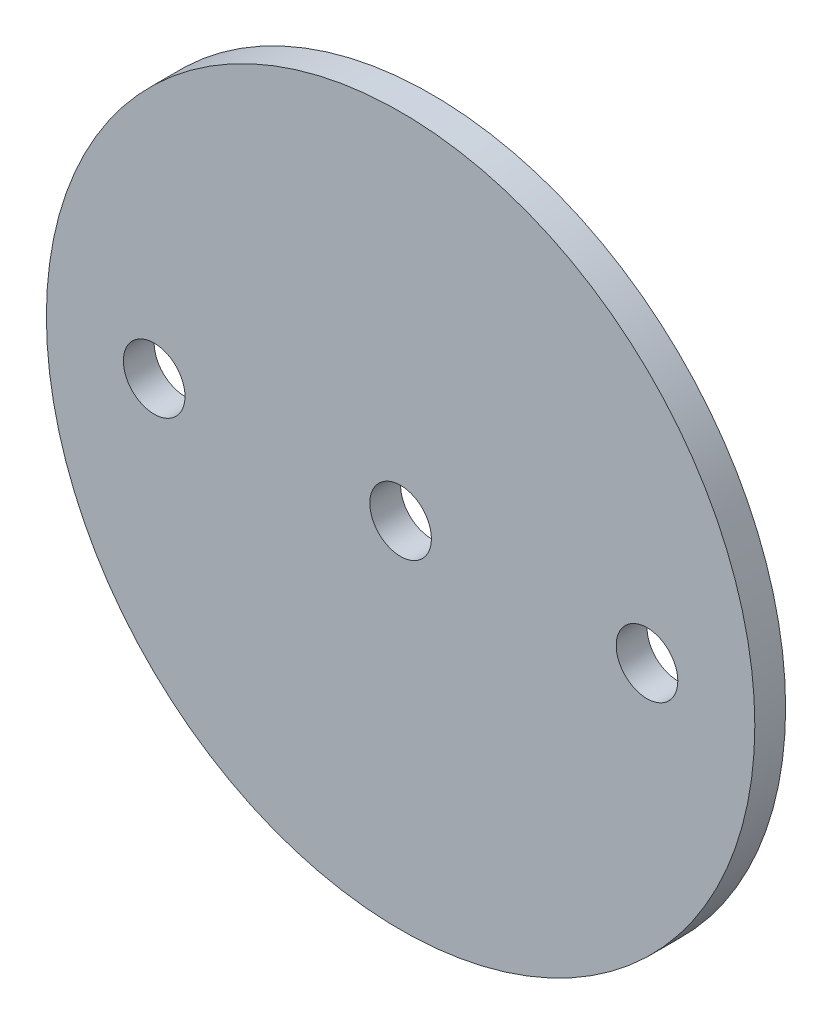
ISO-10303-21;
HEADER;
FILE_DESCRIPTION(('STEP AP214'),'2;1');
FILE_NAME('part.step','',(''),(''),'','','');
FILE_SCHEMA(('AUTOMOTIVE_DESIGN { 1 0 10303 214 1 1 1 1 }'));
ENDSEC;
DATA;
#1=APPLICATION_CONTEXT('core data for automotive mechanical design processes');
#2=APPLICATION_PROTOCOL_DEFINITION('international standard','automotive_design',2000,#1);
#3=PRODUCT_CONTEXT('',#1,'mechanical');
#4=PRODUCT('Part','Part','',(#3));
#5=PRODUCT_RELATED_PRODUCT_CATEGORY('part','',(#4));
#6=PRODUCT_DEFINITION_FORMATION('','',#4);
#7=PRODUCT_DEFINITION_CONTEXT('part definition',#1,'design');
#8=PRODUCT_DEFINITION('design','',#6,#7);
#9=PRODUCT_DEFINITION_SHAPE('','',#8);
#10=(LENGTH_UNIT() NAMED_UNIT(*) SI_UNIT(.MILLI.,.METRE.));
#11=(NAMED_UNIT(*) PLANE_ANGLE_UNIT() SI_UNIT($,.RADIAN.));
#12=(NAMED_UNIT(*) SI_UNIT($,.STERADIAN.) SOLID_ANGLE_UNIT());
#13=UNCERTAINTY_MEASURE_WITH_UNIT(LENGTH_MEASURE(1.E-05),#10,'distance_accuracy_value','');
#14=(GEOMETRIC_REPRESENTATION_CONTEXT(3) GLOBAL_UNCERTAINTY_ASSIGNED_CONTEXT((#13)) GLOBAL_UNIT_ASSIGNED_CONTEXT((#10,
#11,#12)) REPRESENTATION_CONTEXT('',''));
#15=CARTESIAN_POINT('',(0.,0.,0.));
#16=DIRECTION('',(0.,0.,1.));
#17=DIRECTION('',(1.,0.,0.));
#18=AXIS2_PLACEMENT_3D('',#15,#16,#17);
#19=CARTESIAN_POINT('',(0.,0.,1.5875));
#20=DIRECTION('',(0.,0.,-1.));
#21=DIRECTION('',(-1.,0.,0.));
#22=AXIS2_PLACEMENT_3D('',#19,#20,#21);
#23=CYLINDRICAL_SURFACE('',#22,36.5125);
#24=CARTESIAN_POINT('',(0.,0.,1.5875));
#25=DIRECTION('',(0.,0.,1.));
#26=DIRECTION('',(1.,0.,0.));
#27=AXIS2_PLACEMENT_3D('',#24,#25,#26);
#28=CIRCLE('',#27,36.5125);
#29=CARTESIAN_POINT('',(36.5125,0.,1.5875));
#30=VERTEX_POINT('',#29);
#31=EDGE_CURVE('E10',#30,#30,#28,.T.);
#32=ORIENTED_EDGE('',*,*,#31,.F.);
#33=EDGE_LOOP('',(#32));
#34=FACE_BOUND('',#33,.T.);
#35=CARTESIAN_POINT('',(0.,0.,-1.5875));
#36=DIRECTION('',(0.,0.,1.));
#37=DIRECTION('',(1.,0.,0.));
#38=AXIS2_PLACEMENT_3D('',#35,#36,#37);
#39=CIRCLE('',#38,36.5125);
#40=CARTESIAN_POINT('',(36.5125,0.,-1.5875));
#41=VERTEX_POINT('',#40);
#42=EDGE_CURVE('E40',#41,#41,#39,.T.);
#43=ORIENTED_EDGE('',*,*,#42,.T.);
#44=EDGE_LOOP('',(#43));
#45=FACE_BOUND('',#44,.T.);
#46=ADVANCED_FACE('F37',(#34,#45),#23,.T.);
#47=CARTESIAN_POINT('',(0.,0.,1.5875));
#48=DIRECTION('',(0.,0.,1.));
#49=DIRECTION('',(1.,0.,0.));
#50=AXIS2_PLACEMENT_3D('',#47,#48,#49);
#51=PLANE('',#50);
#52=CARTESIAN_POINT('',(0.,0.,1.5875));
#53=DIRECTION('',(0.,0.,1.));
#54=DIRECTION('',(1.,0.,0.));
#55=AXIS2_PLACEMENT_3D('',#52,#53,#54);
#56=CIRCLE('',#55,3.17499999999999);
#57=CARTESIAN_POINT('',(3.17499999999999,0.,1.5875));
#58=VERTEX_POINT('',#57);
#59=EDGE_CURVE('E63',#58,#58,#56,.T.);
#60=ORIENTED_EDGE('',*,*,#59,.F.);
#61=EDGE_LOOP('',(#60));
#62=FACE_BOUND('',#61,.T.);
#63=CARTESIAN_POINT('',(25.4,0.,1.5875));
#64=DIRECTION('',(0.,0.,1.));
#65=DIRECTION('',(1.,0.,0.));
#66=AXIS2_PLACEMENT_3D('',#63,#64,#65);
#67=CIRCLE('',#66,3.17499999999999);
#68=CARTESIAN_POINT('',(28.575,0.,1.5875));
#69=VERTEX_POINT('',#68);
#70=EDGE_CURVE('E57',#69,#69,#67,.T.);
#71=ORIENTED_EDGE('',*,*,#70,.F.);
#72=EDGE_LOOP('',(#71));
#73=FACE_BOUND('',#72,.T.);
#74=CARTESIAN_POINT('',(-25.4,0.,1.5875));
#75=DIRECTION('',(0.,0.,1.));
#76=DIRECTION('',(1.,0.,0.));
#77=AXIS2_PLACEMENT_3D('',#74,#75,#76);
#78=CIRCLE('',#77,3.17499999999999);
#79=CARTESIAN_POINT('',(-22.225,0.,1.5875));
#80=VERTEX_POINT('',#79);
#81=EDGE_CURVE('E51',#80,#80,#78,.T.);
#82=ORIENTED_EDGE('',*,*,#81,.F.);
#83=EDGE_LOOP('',(#82));
#84=FACE_BOUND('',#83,.T.);
#85=ORIENTED_EDGE('',*,*,#31,.T.);
#86=EDGE_LOOP('',(#85));
#87=FACE_BOUND('',#86,.T.);
#88=ADVANCED_FACE('F69',(#62,#73,#84,#87),#51,.T.);
#89=CARTESIAN_POINT('',(0.,0.,-1.5875));
#90=DIRECTION('',(0.,0.,1.));
#91=DIRECTION('',(1.,0.,0.));
#92=AXIS2_PLACEMENT_3D('',#89,#90,#91);
#93=PLANE('',#92);
#94=CARTESIAN_POINT('',(0.,0.,-1.5875));
#95=DIRECTION('',(0.,0.,1.));
#96=DIRECTION('',(1.,0.,0.));
#97=AXIS2_PLACEMENT_3D('',#94,#95,#96);
#98=CIRCLE('',#97,3.17499999999999);
#99=CARTESIAN_POINT('',(3.17499999999999,0.,-1.5875));
#100=VERTEX_POINT('',#99);
#101=EDGE_CURVE('E60',#100,#100,#98,.T.);
#102=ORIENTED_EDGE('',*,*,#101,.T.);
#103=EDGE_LOOP('',(#102));
#104=FACE_BOUND('',#103,.T.);
#105=CARTESIAN_POINT('',(25.4,0.,-1.5875));
#106=DIRECTION('',(0.,0.,1.));
#107=DIRECTION('',(1.,0.,0.));
#108=AXIS2_PLACEMENT_3D('',#105,#106,#107);
#109=CIRCLE('',#108,3.17499999999999);
#110=CARTESIAN_POINT('',(28.575,0.,-1.5875));
#111=VERTEX_POINT('',#110);
#112=EDGE_CURVE('E54',#111,#111,#109,.T.);
#113=ORIENTED_EDGE('',*,*,#112,.T.);
#114=EDGE_LOOP('',(#113));
#115=FACE_BOUND('',#114,.T.);
#116=CARTESIAN_POINT('',(-25.4,0.,-1.5875));
#117=DIRECTION('',(0.,0.,1.));
#118=DIRECTION('',(1.,0.,0.));
#119=AXIS2_PLACEMENT_3D('',#116,#117,#118);
#120=CIRCLE('',#119,3.17499999999999);
#121=CARTESIAN_POINT('',(-22.225,0.,-1.5875));
#122=VERTEX_POINT('',#121);
#123=EDGE_CURVE('E47',#122,#122,#120,.T.);
#124=ORIENTED_EDGE('',*,*,#123,.T.);
#125=EDGE_LOOP('',(#124));
#126=FACE_BOUND('',#125,.T.);
#127=ORIENTED_EDGE('',*,*,#42,.F.);
#128=EDGE_LOOP('',(#127));
#129=FACE_BOUND('',#128,.T.);
#130=ADVANCED_FACE('F72',(#104,#115,#126,#129),#93,.F.);
#131=CARTESIAN_POINT('',(-25.4,0.,1.5875));
#132=DIRECTION('',(0.,0.,1.));
#133=DIRECTION('',(1.,0.,0.));
#134=AXIS2_PLACEMENT_3D('',#131,#132,#133);
#135=CYLINDRICAL_SURFACE('',#134,3.17499999999999);
#136=ORIENTED_EDGE('',*,*,#123,.F.);
#137=EDGE_LOOP('',(#136));
#138=FACE_BOUND('',#137,.T.);
#139=ORIENTED_EDGE('',*,*,#81,.T.);
#140=EDGE_LOOP('',(#139));
#141=FACE_BOUND('',#140,.T.);
#142=ADVANCED_FACE('F78',(#138,#141),#135,.F.);
#143=CARTESIAN_POINT('',(25.4,0.,1.5875));
#144=DIRECTION('',(0.,0.,1.));
#145=DIRECTION('',(1.,0.,0.));
#146=AXIS2_PLACEMENT_3D('',#143,#144,#145);
#147=CYLINDRICAL_SURFACE('',#146,3.17499999999999);
#148=ORIENTED_EDGE('',*,*,#112,.F.);
#149=EDGE_LOOP('',(#148));
#150=FACE_BOUND('',#149,.T.);
#151=ORIENTED_EDGE('',*,*,#70,.T.);
#152=EDGE_LOOP('',(#151));
#153=FACE_BOUND('',#152,.T.);
#154=ADVANCED_FACE('F80',(#150,#153),#147,.F.);
#155=CARTESIAN_POINT('',(0.,0.,1.5875));
#156=DIRECTION('',(0.,0.,1.));
#157=DIRECTION('',(1.,0.,0.));
#158=AXIS2_PLACEMENT_3D('',#155,#156,#157);
#159=CYLINDRICAL_SURFACE('',#158,3.17499999999999);
#160=ORIENTED_EDGE('',*,*,#101,.F.);
#161=EDGE_LOOP('',(#160));
#162=FACE_BOUND('',#161,.T.);
#163=ORIENTED_EDGE('',*,*,#59,.T.);
#164=EDGE_LOOP('',(#163));
#165=FACE_BOUND('',#164,.T.);
#166=ADVANCED_FACE('F67',(#162,#165),#159,.F.);
#167=CLOSED_SHELL('',(#46,#88,#130,#142,#154,#166));
#168=MANIFOLD_SOLID_BREP('B2',#167);
#169=ADVANCED_BREP_SHAPE_REPRESENTATION('',(#18,#168),#14);
#170=SHAPE_DEFINITION_REPRESENTATION(#9,#169);
ENDSEC;
END-ISO-10303-21;
